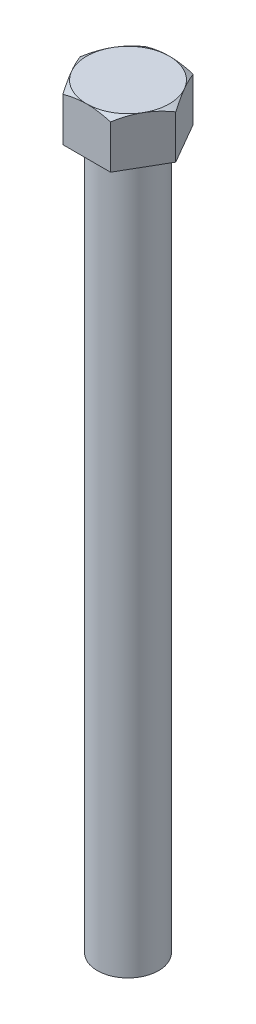
ISO-10303-21;
HEADER;
FILE_DESCRIPTION(('STEP AP214'),'2;1');
FILE_NAME('part.step','',(''),(''),'','','');
FILE_SCHEMA(('AUTOMOTIVE_DESIGN { 1 0 10303 214 1 1 1 1 }'));
ENDSEC;
DATA;
#1=APPLICATION_CONTEXT('core data for automotive mechanical design processes');
#2=APPLICATION_PROTOCOL_DEFINITION('international standard','automotive_design',2000,#1);
#3=PRODUCT_CONTEXT('',#1,'mechanical');
#4=PRODUCT('Part','Part','',(#3));
#5=PRODUCT_RELATED_PRODUCT_CATEGORY('part','',(#4));
#6=PRODUCT_DEFINITION_FORMATION('','',#4);
#7=PRODUCT_DEFINITION_CONTEXT('part definition',#1,'design');
#8=PRODUCT_DEFINITION('design','',#6,#7);
#9=PRODUCT_DEFINITION_SHAPE('','',#8);
#10=(LENGTH_UNIT() NAMED_UNIT(*) SI_UNIT(.MILLI.,.METRE.));
#11=(NAMED_UNIT(*) PLANE_ANGLE_UNIT() SI_UNIT($,.RADIAN.));
#12=(NAMED_UNIT(*) SI_UNIT($,.STERADIAN.) SOLID_ANGLE_UNIT());
#13=UNCERTAINTY_MEASURE_WITH_UNIT(LENGTH_MEASURE(1.E-05),#10,'distance_accuracy_value','');
#14=(GEOMETRIC_REPRESENTATION_CONTEXT(3) GLOBAL_UNCERTAINTY_ASSIGNED_CONTEXT((#13)) GLOBAL_UNIT_ASSIGNED_CONTEXT((#10,
#11,#12)) REPRESENTATION_CONTEXT('',''));
#15=CARTESIAN_POINT('',(0.,0.,0.));
#16=DIRECTION('',(0.,0.,1.));
#17=DIRECTION('',(1.,0.,0.));
#18=AXIS2_PLACEMENT_3D('',#15,#16,#17);
#19=CARTESIAN_POINT('',(-20.2072594216369,20.,0.));
#20=DIRECTION('',(0.866025403784439,0.,-0.5));
#21=DIRECTION('',(-0.5,0.,-0.866025403784439));
#22=AXIS2_PLACEMENT_3D('',#19,#20,#21);
#23=PLANE('',#22);
#24=CARTESIAN_POINT('',(-20.2073748916907,18.4368963769137,-0.000200000000004996));
#25=CARTESIAN_POINT('',(-19.9853012439728,18.5651018970761,0.38444284086957));
#26=CARTESIAN_POINT('',(-19.762361389816,18.6874896599381,0.770585995301255));
#27=CARTESIAN_POINT('',(-19.3146939681843,18.9190125395864,1.54596871446072));
#28=CARTESIAN_POINT('',(-19.0899658384811,19.0281432976117,1.9352092529966));
#29=CARTESIAN_POINT('',(-18.6382875356229,19.2316852290274,2.71753902222344));
#30=CARTESIAN_POINT('',(-18.4113334098389,19.326061574273,3.11063509906872));
#31=CARTESIAN_POINT('',(-17.9558481582161,19.4980681087349,3.89955869697771));
#32=CARTESIAN_POINT('',(-17.7273171234664,19.5756992570063,4.29538606027048));
#33=CARTESIAN_POINT('',(-17.2745337948975,19.710913518507,5.07962979017197));
#34=CARTESIAN_POINT('',(-17.0503151156284,19.7689441668334,5.46798793467199));
#35=CARTESIAN_POINT('',(-16.6008503535931,19.8662485621129,6.24648373872895));
#36=CARTESIAN_POINT('',(-16.3756042511352,19.9055219480237,6.63662143239296));
#37=CARTESIAN_POINT('',(-15.9247336728193,19.9643201883632,7.41755218167411));
#38=CARTESIAN_POINT('',(-15.6991099672215,19.9838685099516,7.80834390316137));
#39=CARTESIAN_POINT('',(-15.2476542960732,20.0027962227259,8.5902880629553));
#40=CARTESIAN_POINT('',(-15.0218223371735,20.0021762371288,8.98144048974237));
#41=CARTESIAN_POINT('',(-14.5996240733686,19.9821758582902,9.71270933351997));
#42=CARTESIAN_POINT('',(-14.4032276872714,19.9652343325198,10.0528778526632));
#43=CARTESIAN_POINT('',(-14.0109033957582,19.916419199074,10.7324034586075));
#44=CARTESIAN_POINT('',(-13.8149754836732,19.884545805248,11.0717605569595));
#45=CARTESIAN_POINT('',(-13.4236623720976,19.8064199982838,11.7495347478764));
#46=CARTESIAN_POINT('',(-13.2282778252369,19.7601545821978,12.0879507100529));
#47=CARTESIAN_POINT('',(-12.8384388470893,19.6540611349858,12.7631716269754));
#48=CARTESIAN_POINT('',(-12.6439844118645,19.5942331613299,13.0999765885417));
#49=CARTESIAN_POINT('',(-12.0536928860081,19.392883792784,14.1223915026024));
#50=CARTESIAN_POINT('',(-11.6595652216358,19.2312852470129,14.8050406419636));
#51=CARTESIAN_POINT('',(-10.8771867454713,18.8645228633406,16.160159913429));
#52=CARTESIAN_POINT('',(-10.4889259169705,18.659445158294,16.832647394981));
#53=CARTESIAN_POINT('',(-10.1035142407646,18.4368963769137,17.5002));
#54=B_SPLINE_CURVE_WITH_KNOTS('',3,(#24,#25,#26,#27,#28,#29,#30,#31,#32,#33,#34,#35,#36,#37,#38,
#39,#40,#41,#42,#43,#44,#45,#46,#47,#48,#49,#50,#51,#52,#53),.UNSPECIFIED.,.F.,.F.,(4,2,2,2,2,2,
2,2,2,2,2,2,2,2,4),(0.,1.38687848403849,2.77421173170711,4.16477191318454,5.55525243132748,
6.91141289674697,8.26759946466404,9.62217065102979,10.9766999800844,12.1558895383344,
13.3350622091354,14.5153033519314,15.6955394936483,18.108000007275,20.5157253255525),.UNSPECIFIED.);
#55=CARTESIAN_POINT('',(-20.2072594216369,18.4369630441518,0.));
#56=VERTEX_POINT('',#55);
#57=CARTESIAN_POINT('',(-15.1554445662277,20.,8.74999999999999));
#58=VERTEX_POINT('',#57);
#59=EDGE_CURVE('E221',#56,#58,#54,.T.);
#60=ORIENTED_EDGE('',*,*,#59,.F.);
#61=DIRECTION('',(0.,-1.,0.));
#62=VECTOR('',#61,1.);
#63=CARTESIAN_POINT('',(-20.2072594216369,20.,0.));
#64=LINE('',#63,#62);
#65=CARTESIAN_POINT('',(-20.2072594216369,0.,0.));
#66=VERTEX_POINT('',#65);
#67=EDGE_CURVE('E224',#56,#66,#64,.T.);
#68=ORIENTED_EDGE('',*,*,#67,.T.);
#69=DIRECTION('',(0.5,0.,0.866025403784439));
#70=VECTOR('',#69,1.);
#71=CARTESIAN_POINT('',(-20.2072594216369,0.,0.));
#72=LINE('',#71,#70);
#73=CARTESIAN_POINT('',(-10.1036297108185,0.,17.5));
#74=VERTEX_POINT('',#73);
#75=EDGE_CURVE('E227',#66,#74,#72,.T.);
#76=ORIENTED_EDGE('',*,*,#75,.T.);
#77=DIRECTION('',(0.,-1.,0.));
#78=VECTOR('',#77,1.);
#79=CARTESIAN_POINT('',(-10.1036297108185,20.,17.5));
#80=LINE('',#79,#78);
#81=CARTESIAN_POINT('',(-10.1036297108185,18.4369630441518,17.5));
#82=VERTEX_POINT('',#81);
#83=EDGE_CURVE('E245',#82,#74,#80,.T.);
#84=ORIENTED_EDGE('',*,*,#83,.F.);
#85=EDGE_CURVE('E176',#58,#82,#54,.T.);
#86=ORIENTED_EDGE('',*,*,#85,.F.);
#87=EDGE_LOOP('',(#60,#68,#76,#84,#86));
#88=FACE_BOUND('',#87,.T.);
#89=ADVANCED_FACE('F41',(#88),#23,.F.);
#90=CARTESIAN_POINT('',(-10.1036297108185,20.,17.5));
#91=DIRECTION('',(0.,0.,-1.));
#92=DIRECTION('',(-1.,0.,0.));
#93=AXIS2_PLACEMENT_3D('',#90,#91,#92);
#94=PLANE('',#93);
#95=CARTESIAN_POINT('',(-37.1342299385578,6.40270825805861,17.5));
#96=CARTESIAN_POINT('',(-36.7050552007194,6.62684768715783,17.5));
#97=CARTESIAN_POINT('',(-36.2755925314412,6.85043562191977,17.5));
#98=CARTESIAN_POINT('',(-35.4160345572368,7.29639467079372,17.5));
#99=CARTESIAN_POINT('',(-34.9859392507036,7.51876578180816,17.5));
#100=CARTESIAN_POINT('',(-33.6945888750346,8.18389873910812,17.5));
#101=CARTESIAN_POINT('',(-32.8323028610912,8.62466268574762,17.5));
#102=CARTESIAN_POINT('',(-31.1031779757147,9.5003530167607,17.5));
#103=CARTESIAN_POINT('',(-30.2363342795191,9.93526988380032,17.5));
#104=CARTESIAN_POINT('',(-28.49868278442,10.7970935932979,17.5));
#105=CARTESIAN_POINT('',(-27.6278750425274,11.2240005505046,17.5));
#106=CARTESIAN_POINT('',(-25.8321046614099,12.091666876691,17.5));
#107=CARTESIAN_POINT('',(-24.9068614392283,12.5318466318588,17.5));
#108=CARTESIAN_POINT('',(-23.049660490168,13.3979761123878,17.5));
#109=CARTESIAN_POINT('',(-22.1177025019108,13.8239252801322,17.5));
#110=CARTESIAN_POINT('',(-20.7137889755934,14.4487824702079,17.5));
#111=CARTESIAN_POINT('',(-20.2449396263641,14.6546740745884,17.5));
#112=CARTESIAN_POINT('',(-19.3049272696673,15.0611003526178,17.5));
#113=CARTESIAN_POINT('',(-18.8337642900339,15.2616350905262,17.5));
#114=CARTESIAN_POINT('',(-17.8888895456256,15.6565290641438,17.5));
#115=CARTESIAN_POINT('',(-17.4151779507797,15.8508887057541,17.5));
#116=CARTESIAN_POINT('',(-16.4648986501419,16.2324805719486,17.5));
#117=CARTESIAN_POINT('',(-15.9883309987324,16.4197129317477,17.5));
#118=CARTESIAN_POINT('',(-14.9768285535341,16.807063497541,17.5));
#119=CARTESIAN_POINT('',(-14.4415064354391,17.0061743187637,17.5));
#120=CARTESIAN_POINT('',(-13.3664969973764,17.3922684251086,17.5));
#121=CARTESIAN_POINT('',(-12.8268096844841,17.5792517298834,17.5));
#122=CARTESIAN_POINT('',(-11.7425232987771,17.9389269524442,17.5));
#123=CARTESIAN_POINT('',(-11.1979231934637,18.1116157845855,17.5));
#124=CARTESIAN_POINT('',(-10.1036856943388,18.4400696553717,17.5));
#125=CARTESIAN_POINT('',(-9.55404830405359,18.595834705863,17.5));
#126=CARTESIAN_POINT('',(-7.91983994543748,19.0273884674486,17.5));
#127=CARTESIAN_POINT('',(-6.82743700423243,19.2751364665316,17.5));
#128=CARTESIAN_POINT('',(-5.17573567402459,19.571704137182,17.5));
#129=CARTESIAN_POINT('',(-4.62306517213712,19.6580440366128,17.5));
#130=CARTESIAN_POINT('',(-3.51404360795832,19.80303068123,17.5));
#131=CARTESIAN_POINT('',(-2.95769260016417,19.8616778355359,17.5));
#132=CARTESIAN_POINT('',(-1.83264136868664,19.9499349469567,17.5));
#133=CARTESIAN_POINT('',(-1.26389843185352,19.9790060289503,17.5));
#134=CARTESIAN_POINT('',(-0.125671171069441,20.0050744167302,17.5));
#135=CARTESIAN_POINT('',(0.443813147886864,20.0020719374883,17.5));
#136=CARTESIAN_POINT('',(1.58177040235511,19.9641154718686,17.5));
#137=CARTESIAN_POINT('',(2.15024320881292,19.9291576656183,17.5));
#138=CARTESIAN_POINT('',(3.2844641346737,19.8286841286062,17.5));
#139=CARTESIAN_POINT('',(3.85021217776182,19.7631675469289,17.5));
#140=CARTESIAN_POINT('',(4.98983856137423,19.6022561225683,17.5));
#141=CARTESIAN_POINT('',(5.56362942185603,19.5062479074223,17.5));
#142=CARTESIAN_POINT('',(6.70621698323437,19.2880159992909,17.5));
#143=CARTESIAN_POINT('',(7.27501313771664,19.1657894743507,17.5));
#144=CARTESIAN_POINT('',(8.40738604614392,18.8984677114559,17.5));
#145=CARTESIAN_POINT('',(8.97096076963816,18.7533639424041,17.5));
#146=CARTESIAN_POINT('',(10.0926704652092,18.4435931789192,17.5));
#147=CARTESIAN_POINT('',(10.6508054317914,18.2789261647276,17.5));
#148=CARTESIAN_POINT('',(11.7916379634836,17.9237320908199,17.5));
#149=CARTESIAN_POINT('',(12.3740499393929,17.732292330162,17.5));
#150=CARTESIAN_POINT('',(13.5335931334384,17.3339914435558,17.5));
#151=CARTESIAN_POINT('',(14.1107239885547,17.1271292662922,17.5));
#152=CARTESIAN_POINT('',(15.2603638010136,16.700461229358,17.5));
#153=CARTESIAN_POINT('',(15.8328712901451,16.4806514286246,17.5));
#154=CARTESIAN_POINT('',(16.9736016246879,16.030250440018,17.5));
#155=CARTESIAN_POINT('',(17.5418245632024,15.799659487207,17.5));
#156=CARTESIAN_POINT('',(18.6753501670238,15.3290640636593,17.5));
#157=CARTESIAN_POINT('',(19.2406471650521,15.0890459757007,17.5));
#158=CARTESIAN_POINT('',(20.3679192934109,14.6013408620988,17.5));
#159=CARTESIAN_POINT('',(20.9298944099371,14.3536538046134,17.5));
#160=CARTESIAN_POINT('',(22.0508347666414,13.8518187890975,17.5));
#161=CARTESIAN_POINT('',(22.6098004960584,13.597671922192,17.5));
#162=CARTESIAN_POINT('',(23.7251696915639,13.0838289333962,17.5));
#163=CARTESIAN_POINT('',(24.2815731635452,12.8241328242755,17.5));
#164=CARTESIAN_POINT('',(25.875648635559,12.0718045852066,17.5));
#165=CARTESIAN_POINT('',(26.9105231799647,11.5732436699823,17.5));
#166=CARTESIAN_POINT('',(28.9741272595372,10.5634927941383,17.5));
#167=CARTESIAN_POINT('',(30.0028565059696,10.0523022458265,17.5));
#168=CARTESIAN_POINT('',(32.0509714248645,9.02233607504946,17.5));
#169=CARTESIAN_POINT('',(33.0703782513089,8.50360246813269,17.5));
#170=CARTESIAN_POINT('',(34.5964715808163,7.71976558777191,17.5));
#171=CARTESIAN_POINT('',(35.1046418034072,7.45754349116547,17.5));
#172=CARTESIAN_POINT('',(36.1200848701398,6.93137284344838,17.5));
#173=CARTESIAN_POINT('',(36.6273577183409,6.6674243001729,17.5));
#174=CARTESIAN_POINT('',(37.1342299385578,6.40270825805861,17.5));
#175=B_SPLINE_CURVE_WITH_KNOTS('',3,(#95,#96,#97,#98,#99,#100,#101,#102,#103,#104,#105,#106,
#107,#108,#109,#110,#111,#112,#113,#114,#115,#116,#117,#118,#119,#120,#121,#122,#123,#124,#125,
#126,#127,#128,#129,#130,#131,#132,#133,#134,#135,#136,#137,#138,#139,#140,#141,#142,#143,#144,
#145,#146,#147,#148,#149,#150,#151,#152,#153,#154,#155,#156,#157,#158,#159,#160,#161,#162,#163,
#164,#165,#166,#167,#168,#169,#170,#171,#172,#173,#174),.UNSPECIFIED.,.F.,.F.,(4,2,2,2,2,2,2,2,
2,2,2,2,2,2,2,2,2,2,2,2,2,2,2,2,2,2,2,2,2,2,2,2,2,2,2,2,2,2,2,4),(0.,1.4525366588957,
2.90507701367287,5.81027117112893,8.71972931265272,11.6291457418612,14.7029003099166,
17.7767751802251,19.3129449942613,20.8490963725306,22.3851465667765,23.9211676053677,
25.6344965210927,27.3478226602961,29.0615176835703,30.7752115072696,34.1312752191696,
35.808830600931,37.4863611985102,39.193936734538,40.9015008256106,42.609269062001,
44.3170848543991,46.0616991535557,47.8065019911547,49.5519570246161,51.2974138209741,
53.136360005362,54.9754316618747,56.8150660263597,58.6546602998614,60.4970172921601,
62.3393819350914,64.1814374259031,66.0234886782735,69.4694827128661,72.9156374023528,
76.3469886389239,78.0624967610741,79.7779971030996),.UNSPECIFIED.);
#176=CARTESIAN_POINT('',(0.,20.,17.5));
#177=VERTEX_POINT('',#176);
#178=EDGE_CURVE('E270',#82,#177,#175,.T.);
#179=ORIENTED_EDGE('',*,*,#178,.F.);
#180=ORIENTED_EDGE('',*,*,#83,.T.);
#181=DIRECTION('',(1.,0.,0.));
#182=VECTOR('',#181,1.);
#183=CARTESIAN_POINT('',(-10.1036297108185,0.,17.5));
#184=LINE('',#183,#182);
#185=CARTESIAN_POINT('',(10.1036297108184,0.,17.5));
#186=VERTEX_POINT('',#185);
#187=EDGE_CURVE('E265',#74,#186,#184,.T.);
#188=ORIENTED_EDGE('',*,*,#187,.T.);
#189=DIRECTION('',(0.,-1.,0.));
#190=VECTOR('',#189,1.);
#191=CARTESIAN_POINT('',(10.1036297108184,20.,17.5));
#192=LINE('',#191,#190);
#193=CARTESIAN_POINT('',(10.1036297108184,18.4369630441518,17.5));
#194=VERTEX_POINT('',#193);
#195=EDGE_CURVE('E244',#194,#186,#192,.T.);
#196=ORIENTED_EDGE('',*,*,#195,.F.);
#197=EDGE_CURVE('E118',#177,#194,#175,.T.);
#198=ORIENTED_EDGE('',*,*,#197,.F.);
#199=EDGE_LOOP('',(#179,#180,#188,#196,#198));
#200=FACE_BOUND('',#199,.T.);
#201=ADVANCED_FACE('F212',(#200),#94,.F.);
#202=CARTESIAN_POINT('',(10.1036297108184,20.,17.5));
#203=DIRECTION('',(-0.866025403784439,0.,-0.5));
#204=DIRECTION('',(-0.5,0.,0.866025403784439));
#205=AXIS2_PLACEMENT_3D('',#202,#203,#204);
#206=PLANE('',#205);
#207=CARTESIAN_POINT('',(10.1035142407646,18.4368963769137,17.5002));
#208=CARTESIAN_POINT('',(10.3255878884825,18.5651018970761,17.1155571591304));
#209=CARTESIAN_POINT('',(10.5485277426394,18.6874896599381,16.7294140046987));
#210=CARTESIAN_POINT('',(10.9961951642711,18.9190125395864,15.9540312855393));
#211=CARTESIAN_POINT('',(11.2209232939743,19.0281432976117,15.5647907470034));
#212=CARTESIAN_POINT('',(11.6726015968325,19.2316852290274,14.7824609777766));
#213=CARTESIAN_POINT('',(11.8995557226165,19.326061574273,14.3893649009313));
#214=CARTESIAN_POINT('',(12.3550409742393,19.4980681087349,13.6004413030223));
#215=CARTESIAN_POINT('',(12.583572008989,19.5756992570063,13.2046139397295));
#216=CARTESIAN_POINT('',(13.0363553375579,19.710913518507,12.420370209828));
#217=CARTESIAN_POINT('',(13.2605740168269,19.7689441668334,12.032012065328));
#218=CARTESIAN_POINT('',(13.7100387788622,19.8662485621129,11.253516261271));
#219=CARTESIAN_POINT('',(13.9352848813202,19.9055219480237,10.863378567607));
#220=CARTESIAN_POINT('',(14.3861554596361,19.9643201883632,10.0824478183259));
#221=CARTESIAN_POINT('',(14.6117791652338,19.9838685099516,9.69165609683862));
#222=CARTESIAN_POINT('',(15.0632348363821,20.0027962227259,8.9097119370447));
#223=CARTESIAN_POINT('',(15.2890667952818,20.0021762371288,8.51855951025762));
#224=CARTESIAN_POINT('',(15.7112650590868,19.9821758582902,7.78729066648002));
#225=CARTESIAN_POINT('',(15.907661445184,19.9652343325198,7.44712214733676));
#226=CARTESIAN_POINT('',(16.2999857366972,19.916419199074,6.76759654139246));
#227=CARTESIAN_POINT('',(16.4959136487821,19.884545805248,6.42823944304047));
#228=CARTESIAN_POINT('',(16.8872267603578,19.8064199982838,5.75046525212358));
#229=CARTESIAN_POINT('',(17.0826113072184,19.7601545821979,5.41204928994711));
#230=CARTESIAN_POINT('',(17.4724502853661,19.6540611349858,4.73682837302461));
#231=CARTESIAN_POINT('',(17.6669047205908,19.5942331613299,4.40002341145826));
#232=CARTESIAN_POINT('',(18.2571962464472,19.392883792784,3.37760849739757));
#233=CARTESIAN_POINT('',(18.6513239108195,19.2312852470129,2.69495935803635));
#234=CARTESIAN_POINT('',(19.4337023869841,18.8645228633406,1.33984008657099));
#235=CARTESIAN_POINT('',(19.8219632154848,18.659445158294,0.667352605018959));
#236=CARTESIAN_POINT('',(20.2073748916907,18.4368963769137,-0.00020000000000101));
#237=B_SPLINE_CURVE_WITH_KNOTS('',3,(#207,#208,#209,#210,#211,#212,#213,#214,#215,#216,#217,
#218,#219,#220,#221,#222,#223,#224,#225,#226,#227,#228,#229,#230,#231,#232,#233,#234,#235,#236),
.UNSPECIFIED.,.F.,.F.,(4,2,2,2,2,2,2,2,2,2,2,2,2,2,4),(0.,1.38687848403849,2.77421173170711,
4.16477191318455,5.55525243132748,6.91141289674698,8.26759946466405,9.62217065102979,
10.9766999800844,12.1558895383344,13.3350622091354,14.5153033519314,15.6955394936483,
18.1080000072751,20.5157253255525),.UNSPECIFIED.);
#238=CARTESIAN_POINT('',(15.1554445662277,20.,8.74999999999999));
#239=VERTEX_POINT('',#238);
#240=EDGE_CURVE('E114',#194,#239,#237,.T.);
#241=ORIENTED_EDGE('',*,*,#240,.F.);
#242=ORIENTED_EDGE('',*,*,#195,.T.);
#243=DIRECTION('',(0.5,0.,-0.866025403784439));
#244=VECTOR('',#243,1.);
#245=CARTESIAN_POINT('',(10.1036297108184,0.,17.5));
#246=LINE('',#245,#244);
#247=CARTESIAN_POINT('',(20.2072594216369,0.,0.));
#248=VERTEX_POINT('',#247);
#249=EDGE_CURVE('E266',#186,#248,#246,.T.);
#250=ORIENTED_EDGE('',*,*,#249,.T.);
#251=DIRECTION('',(0.,-1.,0.));
#252=VECTOR('',#251,1.);
#253=CARTESIAN_POINT('',(20.2072594216369,20.,0.));
#254=LINE('',#253,#252);
#255=CARTESIAN_POINT('',(20.2072594216369,18.4369630441518,0.));
#256=VERTEX_POINT('',#255);
#257=EDGE_CURVE('E141',#256,#248,#254,.T.);
#258=ORIENTED_EDGE('',*,*,#257,.F.);
#259=EDGE_CURVE('E122',#239,#256,#237,.T.);
#260=ORIENTED_EDGE('',*,*,#259,.F.);
#261=EDGE_LOOP('',(#241,#242,#250,#258,#260));
#262=FACE_BOUND('',#261,.T.);
#263=ADVANCED_FACE('F139',(#262),#206,.F.);
#264=CARTESIAN_POINT('',(20.2072594216369,20.,0.));
#265=DIRECTION('',(-0.866025403784439,0.,0.5));
#266=DIRECTION('',(0.5,0.,0.866025403784439));
#267=AXIS2_PLACEMENT_3D('',#264,#265,#266);
#268=PLANE('',#267);
#269=CARTESIAN_POINT('',(20.2073748916907,18.4368963769137,0.000200000000000091));
#270=CARTESIAN_POINT('',(19.9853012439728,18.5651018970761,-0.384442840869575));
#271=CARTESIAN_POINT('',(19.762361389816,18.6874896599381,-0.770585995301259));
#272=CARTESIAN_POINT('',(19.3146939681843,18.9190125395864,-1.54596871446073));
#273=CARTESIAN_POINT('',(19.089965838481,19.0281432976117,-1.93520925299661));
#274=CARTESIAN_POINT('',(18.6382875356229,19.2316852290274,-2.71753902222344));
#275=CARTESIAN_POINT('',(18.4113334098389,19.326061574273,-3.11063509906872));
#276=CARTESIAN_POINT('',(17.9558481582161,19.4980681087349,-3.89955869697771));
#277=CARTESIAN_POINT('',(17.7273171234664,19.5756992570063,-4.29538606027049));
#278=CARTESIAN_POINT('',(17.2745337948975,19.710913518507,-5.07962979017197));
#279=CARTESIAN_POINT('',(17.0503151156284,19.7689441668334,-5.46798793467199));
#280=CARTESIAN_POINT('',(16.6008503535931,19.8662485621129,-6.24648373872895));
#281=CARTESIAN_POINT('',(16.3756042511352,19.9055219480237,-6.63662143239297));
#282=CARTESIAN_POINT('',(15.9247336728192,19.9643201883632,-7.41755218167412));
#283=CARTESIAN_POINT('',(15.6991099672215,19.9838685099516,-7.80834390316138));
#284=CARTESIAN_POINT('',(15.2476542960732,20.0027962227259,-8.5902880629553));
#285=CARTESIAN_POINT('',(15.0218223371735,20.0021762371288,-8.98144048974238));
#286=CARTESIAN_POINT('',(14.5996240733685,19.9821758582902,-9.71270933351997));
#287=CARTESIAN_POINT('',(14.4032276872713,19.9652343325198,-10.0528778526632));
#288=CARTESIAN_POINT('',(14.0109033957582,19.916419199074,-10.7324034586075));
#289=CARTESIAN_POINT('',(13.8149754836732,19.884545805248,-11.0717605569595));
#290=CARTESIAN_POINT('',(13.4236623720976,19.8064199982838,-11.7495347478764));
#291=CARTESIAN_POINT('',(13.2282778252369,19.7601545821979,-12.0879507100529));
#292=CARTESIAN_POINT('',(12.8384388470893,19.6540611349858,-12.7631716269754));
#293=CARTESIAN_POINT('',(12.6439844118645,19.5942331613299,-13.0999765885417));
#294=CARTESIAN_POINT('',(12.0536928860081,19.392883792784,-14.1223915026024));
#295=CARTESIAN_POINT('',(11.6595652216358,19.2312852470129,-14.8050406419636));
#296=CARTESIAN_POINT('',(10.8771867454713,18.8645228633406,-16.160159913429));
#297=CARTESIAN_POINT('',(10.4889259169705,18.659445158294,-16.832647394981));
#298=CARTESIAN_POINT('',(10.1035142407646,18.4368963769137,-17.5002));
#299=B_SPLINE_CURVE_WITH_KNOTS('',3,(#269,#270,#271,#272,#273,#274,#275,#276,#277,#278,#279,
#280,#281,#282,#283,#284,#285,#286,#287,#288,#289,#290,#291,#292,#293,#294,#295,#296,#297,#298),
.UNSPECIFIED.,.F.,.F.,(4,2,2,2,2,2,2,2,2,2,2,2,2,2,4),(0.,1.38687848403849,2.77421173170711,
4.16477191318454,5.55525243132748,6.91141289674697,8.26759946466404,9.62217065102978,
10.9766999800844,12.1558895383344,13.3350622091354,14.5153033519314,15.6955394936483,
18.108000007275,20.5157253255525),.UNSPECIFIED.);
#300=CARTESIAN_POINT('',(15.1554445662277,20.,-8.74999999999999));
#301=VERTEX_POINT('',#300);
#302=EDGE_CURVE('E128',#256,#301,#299,.T.);
#303=ORIENTED_EDGE('',*,*,#302,.F.);
#304=ORIENTED_EDGE('',*,*,#257,.T.);
#305=DIRECTION('',(-0.5,0.,-0.866025403784439));
#306=VECTOR('',#305,1.);
#307=CARTESIAN_POINT('',(20.2072594216369,0.,0.));
#308=LINE('',#307,#306);
#309=CARTESIAN_POINT('',(10.1036297108184,0.,-17.5));
#310=VERTEX_POINT('',#309);
#311=EDGE_CURVE('E262',#248,#310,#308,.T.);
#312=ORIENTED_EDGE('',*,*,#311,.T.);
#313=DIRECTION('',(0.,-1.,0.));
#314=VECTOR('',#313,1.);
#315=CARTESIAN_POINT('',(10.1036297108184,20.,-17.5));
#316=LINE('',#315,#314);
#317=CARTESIAN_POINT('',(10.1036297108184,18.4369630441518,-17.5));
#318=VERTEX_POINT('',#317);
#319=EDGE_CURVE('E236',#318,#310,#316,.T.);
#320=ORIENTED_EDGE('',*,*,#319,.F.);
#321=EDGE_CURVE('E142',#301,#318,#299,.T.);
#322=ORIENTED_EDGE('',*,*,#321,.F.);
#323=EDGE_LOOP('',(#303,#304,#312,#320,#322));
#324=FACE_BOUND('',#323,.T.);
#325=ADVANCED_FACE('F203',(#324),#268,.F.);
#326=CARTESIAN_POINT('',(10.1036297108184,20.,-17.5));
#327=DIRECTION('',(0.,0.,1.));
#328=DIRECTION('',(1.,0.,0.));
#329=AXIS2_PLACEMENT_3D('',#326,#327,#328);
#330=PLANE('',#329);
#331=CARTESIAN_POINT('',(37.1342299385578,6.40270825805862,-17.5));
#332=CARTESIAN_POINT('',(36.7050552007193,6.62684768715784,-17.5));
#333=CARTESIAN_POINT('',(36.2755925314411,6.85043562191979,-17.5));
#334=CARTESIAN_POINT('',(35.4160345572367,7.29639467079374,-17.5));
#335=CARTESIAN_POINT('',(34.9859392507036,7.51876578180818,-17.5));
#336=CARTESIAN_POINT('',(33.6945888750346,8.18389873910813,-17.5));
#337=CARTESIAN_POINT('',(32.8323028610912,8.62466268574764,-17.5));
#338=CARTESIAN_POINT('',(31.1031779757147,9.50035301676072,-17.5));
#339=CARTESIAN_POINT('',(30.236334279519,9.93526988380033,-17.5));
#340=CARTESIAN_POINT('',(28.49868278442,10.7970935932979,-17.5));
#341=CARTESIAN_POINT('',(27.6278750425274,11.2240005505046,-17.5));
#342=CARTESIAN_POINT('',(25.8321046614099,12.091666876691,-17.5));
#343=CARTESIAN_POINT('',(24.9068614392283,12.5318466318588,-17.5));
#344=CARTESIAN_POINT('',(23.049660490168,13.3979761123878,-17.5));
#345=CARTESIAN_POINT('',(22.1177025019108,13.8239252801322,-17.5));
#346=CARTESIAN_POINT('',(20.7137889755934,14.4487824702079,-17.5));
#347=CARTESIAN_POINT('',(20.2449396263641,14.6546740745885,-17.5));
#348=CARTESIAN_POINT('',(19.3049272696673,15.0611003526178,-17.5));
#349=CARTESIAN_POINT('',(18.8337642900338,15.2616350905262,-17.5));
#350=CARTESIAN_POINT('',(17.8888895456256,15.6565290641438,-17.5));
#351=CARTESIAN_POINT('',(17.4151779507796,15.8508887057541,-17.5));
#352=CARTESIAN_POINT('',(16.4648986501419,16.2324805719486,-17.5));
#353=CARTESIAN_POINT('',(15.9883309987324,16.4197129317477,-17.5));
#354=CARTESIAN_POINT('',(14.9768285535341,16.807063497541,-17.5));
#355=CARTESIAN_POINT('',(14.4415064354391,17.0061743187637,-17.5));
#356=CARTESIAN_POINT('',(13.3664969973763,17.3922684251086,-17.5));
#357=CARTESIAN_POINT('',(12.826809684484,17.5792517298834,-17.5));
#358=CARTESIAN_POINT('',(11.7425232987771,17.9389269524442,-17.5));
#359=CARTESIAN_POINT('',(11.1979231934637,18.1116157845856,-17.5));
#360=CARTESIAN_POINT('',(10.1036856943387,18.4400696553718,-17.5));
#361=CARTESIAN_POINT('',(9.55404830405355,18.5958347058631,-17.5));
#362=CARTESIAN_POINT('',(7.91983994543744,19.0273884674486,-17.5));
#363=CARTESIAN_POINT('',(6.8274370042324,19.2751364665316,-17.5));
#364=CARTESIAN_POINT('',(5.17573567402455,19.571704137182,-17.5));
#365=CARTESIAN_POINT('',(4.62306517213708,19.6580440366128,-17.5));
#366=CARTESIAN_POINT('',(3.51404360795829,19.80303068123,-17.5));
#367=CARTESIAN_POINT('',(2.95769260016414,19.8616778355359,-17.5));
#368=CARTESIAN_POINT('',(1.83264136868661,19.9499349469567,-17.5));
#369=CARTESIAN_POINT('',(1.2638984318535,19.9790060289503,-17.5));
#370=CARTESIAN_POINT('',(0.12567117106942,20.0050744167302,-17.5));
#371=CARTESIAN_POINT('',(-0.443813147886882,20.0020719374883,-17.5));
#372=CARTESIAN_POINT('',(-1.58177040235512,19.9641154718686,-17.5));
#373=CARTESIAN_POINT('',(-2.15024320881294,19.9291576656183,-17.5));
#374=CARTESIAN_POINT('',(-3.28446413467371,19.8286841286062,-17.5));
#375=CARTESIAN_POINT('',(-3.85021217776184,19.7631675469289,-17.5));
#376=CARTESIAN_POINT('',(-4.98983856137425,19.6022561225683,-17.5));
#377=CARTESIAN_POINT('',(-5.56362942185605,19.5062479074222,-17.5));
#378=CARTESIAN_POINT('',(-6.70621698323438,19.2880159992909,-17.5));
#379=CARTESIAN_POINT('',(-7.27501313771666,19.1657894743507,-17.5));
#380=CARTESIAN_POINT('',(-8.40738604614394,18.8984677114559,-17.5));
#381=CARTESIAN_POINT('',(-8.97096076963818,18.7533639424041,-17.5));
#382=CARTESIAN_POINT('',(-10.0926704652093,18.4435931789192,-17.5));
#383=CARTESIAN_POINT('',(-10.6508054317914,18.2789261647276,-17.5));
#384=CARTESIAN_POINT('',(-11.7916379634836,17.9237320908199,-17.5));
#385=CARTESIAN_POINT('',(-12.374049939393,17.732292330162,-17.5));
#386=CARTESIAN_POINT('',(-13.5335931334384,17.3339914435558,-17.5));
#387=CARTESIAN_POINT('',(-14.1107239885547,17.1271292662922,-17.5));
#388=CARTESIAN_POINT('',(-15.2603638010137,16.700461229358,-17.5));
#389=CARTESIAN_POINT('',(-15.8328712901451,16.4806514286246,-17.5));
#390=CARTESIAN_POINT('',(-16.973601624688,16.030250440018,-17.5));
#391=CARTESIAN_POINT('',(-17.5418245632024,15.799659487207,-17.5));
#392=CARTESIAN_POINT('',(-18.6753501670238,15.3290640636593,-17.5));
#393=CARTESIAN_POINT('',(-19.2406471650521,15.0890459757007,-17.5));
#394=CARTESIAN_POINT('',(-20.3679192934109,14.6013408620988,-17.5));
#395=CARTESIAN_POINT('',(-20.9298944099372,14.3536538046134,-17.5));
#396=CARTESIAN_POINT('',(-22.0508347666415,13.8518187890974,-17.5));
#397=CARTESIAN_POINT('',(-22.6098004960584,13.597671922192,-17.5));
#398=CARTESIAN_POINT('',(-23.725169691564,13.0838289333962,-17.5));
#399=CARTESIAN_POINT('',(-24.2815731635452,12.8241328242755,-17.5));
#400=CARTESIAN_POINT('',(-25.875648635559,12.0718045852066,-17.5));
#401=CARTESIAN_POINT('',(-26.9105231799647,11.5732436699823,-17.5));
#402=CARTESIAN_POINT('',(-28.9741272595372,10.5634927941383,-17.5));
#403=CARTESIAN_POINT('',(-30.0028565059696,10.0523022458265,-17.5));
#404=CARTESIAN_POINT('',(-32.0509714248645,9.02233607504945,-17.5));
#405=CARTESIAN_POINT('',(-33.0703782513089,8.50360246813268,-17.5));
#406=CARTESIAN_POINT('',(-34.5964715808163,7.71976558777191,-17.5));
#407=CARTESIAN_POINT('',(-35.1046418034072,7.45754349116547,-17.5));
#408=CARTESIAN_POINT('',(-36.1200848701398,6.93137284344839,-17.5));
#409=CARTESIAN_POINT('',(-36.6273577183409,6.66742430017291,-17.5));
#410=CARTESIAN_POINT('',(-37.1342299385578,6.40270825805861,-17.5));
#411=B_SPLINE_CURVE_WITH_KNOTS('',3,(#331,#332,#333,#334,#335,#336,#337,#338,#339,#340,#341,
#342,#343,#344,#345,#346,#347,#348,#349,#350,#351,#352,#353,#354,#355,#356,#357,#358,#359,#360,
#361,#362,#363,#364,#365,#366,#367,#368,#369,#370,#371,#372,#373,#374,#375,#376,#377,#378,#379,
#380,#381,#382,#383,#384,#385,#386,#387,#388,#389,#390,#391,#392,#393,#394,#395,#396,#397,#398,
#399,#400,#401,#402,#403,#404,#405,#406,#407,#408,#409,#410),.UNSPECIFIED.,.F.,.F.,(4,2,2,2,2,2,
2,2,2,2,2,2,2,2,2,2,2,2,2,2,2,2,2,2,2,2,2,2,2,2,2,2,2,2,2,2,2,2,2,4),(0.,1.4525366588957,
2.90507701367287,5.81027117112893,8.71972931265272,11.6291457418612,14.7029003099166,
17.7767751802251,19.3129449942613,20.8490963725306,22.3851465667765,23.9211676053677,
25.6344965210927,27.3478226602961,29.0615176835703,30.7752115072696,34.1312752191696,
35.808830600931,37.4863611985102,39.1939367345379,40.9015008256106,42.609269062001,
44.3170848543991,46.0616991535557,47.8065019911547,49.5519570246161,51.2974138209741,
53.136360005362,54.9754316618747,56.8150660263597,58.6546602998614,60.4970172921601,
62.3393819350914,64.1814374259031,66.0234886782735,69.4694827128661,72.9156374023528,
76.3469886389239,78.062496761074,79.7779971030995),.UNSPECIFIED.);
#412=CARTESIAN_POINT('',(0.,20.,-17.5));
#413=VERTEX_POINT('',#412);
#414=EDGE_CURVE('E197',#318,#413,#411,.T.);
#415=ORIENTED_EDGE('',*,*,#414,.F.);
#416=ORIENTED_EDGE('',*,*,#319,.T.);
#417=DIRECTION('',(-1.,0.,0.));
#418=VECTOR('',#417,1.);
#419=CARTESIAN_POINT('',(10.1036297108184,0.,-17.5));
#420=LINE('',#419,#418);
#421=CARTESIAN_POINT('',(-10.1036297108184,0.,-17.5));
#422=VERTEX_POINT('',#421);
#423=EDGE_CURVE('E238',#310,#422,#420,.T.);
#424=ORIENTED_EDGE('',*,*,#423,.T.);
#425=DIRECTION('',(0.,-1.,0.));
#426=VECTOR('',#425,1.);
#427=CARTESIAN_POINT('',(-10.1036297108184,20.,-17.5));
#428=LINE('',#427,#426);
#429=CARTESIAN_POINT('',(-10.1036297108184,18.4369630441518,-17.5));
#430=VERTEX_POINT('',#429);
#431=EDGE_CURVE('E234',#430,#422,#428,.T.);
#432=ORIENTED_EDGE('',*,*,#431,.F.);
#433=EDGE_CURVE('E191',#413,#430,#411,.T.);
#434=ORIENTED_EDGE('',*,*,#433,.F.);
#435=EDGE_LOOP('',(#415,#416,#424,#432,#434));
#436=FACE_BOUND('',#435,.T.);
#437=ADVANCED_FACE('F199',(#436),#330,.F.);
#438=CARTESIAN_POINT('',(-10.1036297108184,20.,-17.5));
#439=DIRECTION('',(0.866025403784439,0.,0.5));
#440=DIRECTION('',(0.5,0.,-0.866025403784439));
#441=AXIS2_PLACEMENT_3D('',#438,#439,#440);
#442=PLANE('',#441);
#443=CARTESIAN_POINT('',(-10.1035142407646,18.4368963769137,-17.5002));
#444=CARTESIAN_POINT('',(-10.3255878884825,18.5651018970761,-17.1155571591304));
#445=CARTESIAN_POINT('',(-10.5485277426394,18.6874896599381,-16.7294140046988));
#446=CARTESIAN_POINT('',(-10.9961951642711,18.9190125395864,-15.9540312855393));
#447=CARTESIAN_POINT('',(-11.2209232939743,19.0281432976117,-15.5647907470034));
#448=CARTESIAN_POINT('',(-11.6726015968325,19.2316852290274,-14.7824609777766));
#449=CARTESIAN_POINT('',(-11.8995557226165,19.326061574273,-14.3893649009313));
#450=CARTESIAN_POINT('',(-12.3550409742393,19.4980681087348,-13.6004413030223));
#451=CARTESIAN_POINT('',(-12.583572008989,19.5756992570063,-13.2046139397295));
#452=CARTESIAN_POINT('',(-13.0363553375579,19.710913518507,-12.420370209828));
#453=CARTESIAN_POINT('',(-13.2605740168269,19.7689441668334,-12.032012065328));
#454=CARTESIAN_POINT('',(-13.7100387788622,19.8662485621129,-11.2535162612711));
#455=CARTESIAN_POINT('',(-13.9352848813202,19.9055219480237,-10.863378567607));
#456=CARTESIAN_POINT('',(-14.3861554596361,19.9643201883632,-10.0824478183259));
#457=CARTESIAN_POINT('',(-14.6117791652338,19.9838685099516,-9.69165609683862));
#458=CARTESIAN_POINT('',(-15.0632348363821,20.0027962227259,-8.9097119370447));
#459=CARTESIAN_POINT('',(-15.2890667952818,20.0021762371288,-8.51855951025762));
#460=CARTESIAN_POINT('',(-15.7112650590868,19.9821758582902,-7.78729066648002));
#461=CARTESIAN_POINT('',(-15.907661445184,19.9652343325198,-7.44712214733676));
#462=CARTESIAN_POINT('',(-16.2999857366972,19.916419199074,-6.76759654139246));
#463=CARTESIAN_POINT('',(-16.4959136487821,19.884545805248,-6.42823944304047));
#464=CARTESIAN_POINT('',(-16.8872267603578,19.8064199982838,-5.75046525212358));
#465=CARTESIAN_POINT('',(-17.0826113072184,19.7601545821978,-5.41204928994712));
#466=CARTESIAN_POINT('',(-17.4724502853661,19.6540611349858,-4.73682837302461));
#467=CARTESIAN_POINT('',(-17.6669047205908,19.5942331613299,-4.40002341145827));
#468=CARTESIAN_POINT('',(-18.2571962464472,19.392883792784,-3.37760849739757));
#469=CARTESIAN_POINT('',(-18.6513239108195,19.2312852470129,-2.69495935803635));
#470=CARTESIAN_POINT('',(-19.4337023869841,18.8645228633406,-1.339840086571));
#471=CARTESIAN_POINT('',(-19.8219632154848,18.659445158294,-0.667352605018966));
#472=CARTESIAN_POINT('',(-20.2073748916907,18.4368963769137,0.000199999999996575));
#473=B_SPLINE_CURVE_WITH_KNOTS('',3,(#443,#444,#445,#446,#447,#448,#449,#450,#451,#452,#453,
#454,#455,#456,#457,#458,#459,#460,#461,#462,#463,#464,#465,#466,#467,#468,#469,#470,#471,#472),
.UNSPECIFIED.,.F.,.F.,(4,2,2,2,2,2,2,2,2,2,2,2,2,2,4),(0.,1.38687848403848,2.77421173170711,
4.16477191318455,5.55525243132748,6.91141289674698,8.26759946466405,9.62217065102979,
10.9766999800844,12.1558895383344,13.3350622091354,14.5153033519314,15.6955394936483,
18.1080000072751,20.5157253255525),.UNSPECIFIED.);
#474=CARTESIAN_POINT('',(-15.1554445662277,20.,-8.75));
#475=VERTEX_POINT('',#474);
#476=EDGE_CURVE('E198',#430,#475,#473,.T.);
#477=ORIENTED_EDGE('',*,*,#476,.F.);
#478=ORIENTED_EDGE('',*,*,#431,.T.);
#479=DIRECTION('',(-0.5,0.,0.866025403784439));
#480=VECTOR('',#479,1.);
#481=CARTESIAN_POINT('',(-10.1036297108184,0.,-17.5));
#482=LINE('',#481,#480);
#483=EDGE_CURVE('E232',#422,#66,#482,.T.);
#484=ORIENTED_EDGE('',*,*,#483,.T.);
#485=ORIENTED_EDGE('',*,*,#67,.F.);
#486=EDGE_CURVE('E135',#475,#56,#473,.T.);
#487=ORIENTED_EDGE('',*,*,#486,.F.);
#488=EDGE_LOOP('',(#477,#478,#484,#485,#487));
#489=FACE_BOUND('',#488,.T.);
#490=ADVANCED_FACE('F202',(#489),#442,.F.);
#491=CARTESIAN_POINT('',(0.,0.,0.));
#492=DIRECTION('',(0.,1.,0.));
#493=DIRECTION('',(0.,0.,1.));
#494=AXIS2_PLACEMENT_3D('',#491,#492,#493);
#495=PLANE('',#494);
#496=CARTESIAN_POINT('',(0.,0.,0.));
#497=DIRECTION('',(0.,-1.,0.));
#498=DIRECTION('',(0.,0.,-1.));
#499=AXIS2_PLACEMENT_3D('',#496,#497,#498);
#500=CIRCLE('',#499,13.);
#501=CARTESIAN_POINT('',(0.,0.,-13.));
#502=VERTEX_POINT('',#501);
#503=EDGE_CURVE('E12',#502,#502,#500,.T.);
#504=ORIENTED_EDGE('',*,*,#503,.F.);
#505=EDGE_LOOP('',(#504));
#506=FACE_BOUND('',#505,.T.);
#507=ORIENTED_EDGE('',*,*,#75,.F.);
#508=ORIENTED_EDGE('',*,*,#483,.F.);
#509=ORIENTED_EDGE('',*,*,#423,.F.);
#510=ORIENTED_EDGE('',*,*,#311,.F.);
#511=ORIENTED_EDGE('',*,*,#249,.F.);
#512=ORIENTED_EDGE('',*,*,#187,.F.);
#513=EDGE_LOOP('',(#507,#508,#509,#510,#511,#512));
#514=FACE_BOUND('',#513,.T.);
#515=ADVANCED_FACE('F263',(#506,#514),#495,.F.);
#516=CARTESIAN_POINT('',(0.,20.,0.));
#517=DIRECTION('',(0.,-1.,0.));
#518=DIRECTION('',(0.,0.,1.));
#519=AXIS2_PLACEMENT_3D('',#516,#517,#518);
#520=CONICAL_SURFACE('',#519,17.5,1.0471975511966);
#521=ORIENTED_EDGE('',*,*,#85,.T.);
#522=ORIENTED_EDGE('',*,*,#178,.T.);
#523=CARTESIAN_POINT('',(0.,20.,0.));
#524=DIRECTION('',(0.,1.,0.));
#525=DIRECTION('',(0.,0.,1.));
#526=AXIS2_PLACEMENT_3D('',#523,#524,#525);
#527=CIRCLE('',#526,17.5);
#528=EDGE_CURVE('E45',#58,#177,#527,.T.);
#529=ORIENTED_EDGE('',*,*,#528,.F.);
#530=EDGE_LOOP('',(#521,#522,#529));
#531=FACE_BOUND('',#530,.T.);
#532=ADVANCED_FACE('F169',(#531),#520,.T.);
#533=ORIENTED_EDGE('',*,*,#59,.T.);
#534=EDGE_CURVE('E249',#475,#58,#527,.T.);
#535=ORIENTED_EDGE('',*,*,#534,.F.);
#536=ORIENTED_EDGE('',*,*,#486,.T.);
#537=EDGE_LOOP('',(#533,#535,#536));
#538=FACE_BOUND('',#537,.T.);
#539=ADVANCED_FACE('F163',(#538),#520,.T.);
#540=ORIENTED_EDGE('',*,*,#433,.T.);
#541=ORIENTED_EDGE('',*,*,#476,.T.);
#542=EDGE_CURVE('E66',#413,#475,#527,.T.);
#543=ORIENTED_EDGE('',*,*,#542,.F.);
#544=EDGE_LOOP('',(#540,#541,#543));
#545=FACE_BOUND('',#544,.T.);
#546=ADVANCED_FACE('F168',(#545),#520,.T.);
#547=ORIENTED_EDGE('',*,*,#321,.T.);
#548=ORIENTED_EDGE('',*,*,#414,.T.);
#549=EDGE_CURVE('E131',#301,#413,#527,.T.);
#550=ORIENTED_EDGE('',*,*,#549,.F.);
#551=EDGE_LOOP('',(#547,#548,#550));
#552=FACE_BOUND('',#551,.T.);
#553=ADVANCED_FACE('F282',(#552),#520,.T.);
#554=ORIENTED_EDGE('',*,*,#259,.T.);
#555=ORIENTED_EDGE('',*,*,#302,.T.);
#556=EDGE_CURVE('E50',#239,#301,#527,.T.);
#557=ORIENTED_EDGE('',*,*,#556,.F.);
#558=EDGE_LOOP('',(#554,#555,#557));
#559=FACE_BOUND('',#558,.T.);
#560=ADVANCED_FACE('F126',(#559),#520,.T.);
#561=ORIENTED_EDGE('',*,*,#197,.T.);
#562=ORIENTED_EDGE('',*,*,#240,.T.);
#563=CARTESIAN_POINT('',(0.,20.,0.));
#564=DIRECTION('',(0.,1.,0.));
#565=DIRECTION('',(0.,0.,1.));
#566=AXIS2_PLACEMENT_3D('',#563,#564,#565);
#567=CIRCLE('',#566,17.5);
#568=EDGE_CURVE('E58',#177,#239,#567,.T.);
#569=ORIENTED_EDGE('',*,*,#568,.F.);
#570=EDGE_LOOP('',(#561,#562,#569));
#571=FACE_BOUND('',#570,.T.);
#572=ADVANCED_FACE('F116',(#571),#520,.T.);
#573=CARTESIAN_POINT('',(0.,20.,0.));
#574=DIRECTION('',(0.,1.,0.));
#575=DIRECTION('',(0.,0.,1.));
#576=AXIS2_PLACEMENT_3D('',#573,#574,#575);
#577=PLANE('',#576);
#578=ORIENTED_EDGE('',*,*,#528,.T.);
#579=ORIENTED_EDGE('',*,*,#568,.T.);
#580=ORIENTED_EDGE('',*,*,#556,.T.);
#581=ORIENTED_EDGE('',*,*,#549,.T.);
#582=ORIENTED_EDGE('',*,*,#542,.T.);
#583=ORIENTED_EDGE('',*,*,#534,.T.);
#584=EDGE_LOOP('',(#578,#579,#580,#581,#582,#583));
#585=FACE_BOUND('',#584,.T.);
#586=ADVANCED_FACE('F133',(#585),#577,.T.);
#587=CARTESIAN_POINT('',(0.,-300.,0.));
#588=DIRECTION('',(0.,1.,0.));
#589=DIRECTION('',(0.,0.,1.));
#590=AXIS2_PLACEMENT_3D('',#587,#588,#589);
#591=CYLINDRICAL_SURFACE('',#590,13.);
#592=CARTESIAN_POINT('',(0.,-300.,0.));
#593=DIRECTION('',(0.,-1.,0.));
#594=DIRECTION('',(0.,0.,-1.));
#595=AXIS2_PLACEMENT_3D('',#592,#593,#594);
#596=CIRCLE('',#595,13.);
#597=CARTESIAN_POINT('',(0.,-300.,-13.));
#598=VERTEX_POINT('',#597);
#599=EDGE_CURVE('E136',#598,#598,#596,.T.);
#600=ORIENTED_EDGE('',*,*,#599,.F.);
#601=EDGE_LOOP('',(#600));
#602=FACE_BOUND('',#601,.T.);
#603=ORIENTED_EDGE('',*,*,#503,.T.);
#604=EDGE_LOOP('',(#603));
#605=FACE_BOUND('',#604,.T.);
#606=ADVANCED_FACE('F171',(#602,#605),#591,.T.);
#607=CARTESIAN_POINT('',(0.,-300.,0.));
#608=DIRECTION('',(0.,-1.,0.));
#609=DIRECTION('',(0.,0.,-1.));
#610=AXIS2_PLACEMENT_3D('',#607,#608,#609);
#611=PLANE('',#610);
#612=ORIENTED_EDGE('',*,*,#599,.T.);
#613=EDGE_LOOP('',(#612));
#614=FACE_BOUND('',#613,.T.);
#615=ADVANCED_FACE('F345',(#614),#611,.T.);
#616=CLOSED_SHELL('',(#89,#201,#263,#325,#437,#490,#515,#532,#539,#546,#553,#560,#572,#586,#606,#615));
#617=MANIFOLD_SOLID_BREP('B2',#616);
#618=ADVANCED_BREP_SHAPE_REPRESENTATION('',(#18,#617),#14);
#619=SHAPE_DEFINITION_REPRESENTATION(#9,#618);
ENDSEC;
END-ISO-10303-21;
